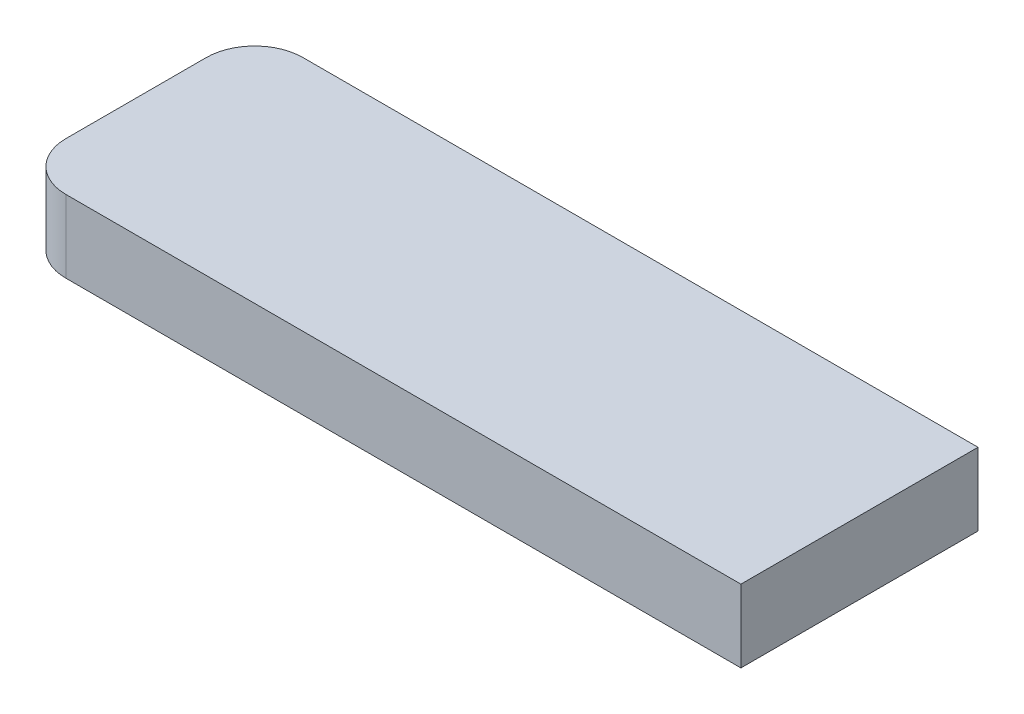
ISO-10303-21;
HEADER;
FILE_DESCRIPTION(('STEP AP214'),'2;1');
FILE_NAME('part.step','',(''),(''),'','','');
FILE_SCHEMA(('AUTOMOTIVE_DESIGN { 1 0 10303 214 1 1 1 1 }'));
ENDSEC;
DATA;
#1=APPLICATION_CONTEXT('core data for automotive mechanical design processes');
#2=APPLICATION_PROTOCOL_DEFINITION('international standard','automotive_design',2000,#1);
#3=PRODUCT_CONTEXT('',#1,'mechanical');
#4=PRODUCT('Part','Part','',(#3));
#5=PRODUCT_RELATED_PRODUCT_CATEGORY('part','',(#4));
#6=PRODUCT_DEFINITION_FORMATION('','',#4);
#7=PRODUCT_DEFINITION_CONTEXT('part definition',#1,'design');
#8=PRODUCT_DEFINITION('design','',#6,#7);
#9=PRODUCT_DEFINITION_SHAPE('','',#8);
#10=(LENGTH_UNIT() NAMED_UNIT(*) SI_UNIT(.MILLI.,.METRE.));
#11=(NAMED_UNIT(*) PLANE_ANGLE_UNIT() SI_UNIT($,.RADIAN.));
#12=(NAMED_UNIT(*) SI_UNIT($,.STERADIAN.) SOLID_ANGLE_UNIT());
#13=UNCERTAINTY_MEASURE_WITH_UNIT(LENGTH_MEASURE(1.E-05),#10,'distance_accuracy_value','');
#14=(GEOMETRIC_REPRESENTATION_CONTEXT(3) GLOBAL_UNCERTAINTY_ASSIGNED_CONTEXT((#13)) GLOBAL_UNIT_ASSIGNED_CONTEXT((#10,
#11,#12)) REPRESENTATION_CONTEXT('',''));
#15=CARTESIAN_POINT('',(0.,0.,0.));
#16=DIRECTION('',(0.,0.,1.));
#17=DIRECTION('',(1.,0.,0.));
#18=AXIS2_PLACEMENT_3D('',#15,#16,#17);
#19=CARTESIAN_POINT('',(300.,1.71683972880179E-13,0.));
#20=DIRECTION('',(-1.,0.,0.));
#21=DIRECTION('',(0.,-1.,0.));
#22=AXIS2_PLACEMENT_3D('',#19,#20,#21);
#23=PLANE('',#22);
#24=DIRECTION('',(0.,0.,1.));
#25=VECTOR('',#24,1.);
#26=CARTESIAN_POINT('',(300.,-47.,3.));
#27=LINE('',#26,#25);
#28=CARTESIAN_POINT('',(300.,-47.,40.1));
#29=VERTEX_POINT('',#28);
#30=CARTESIAN_POINT('',(300.,-47.,49.9));
#31=VERTEX_POINT('',#30);
#32=EDGE_CURVE('E97',#29,#31,#27,.T.);
#33=ORIENTED_EDGE('',*,*,#32,.T.);
#34=DIRECTION('',(0.,1.,0.));
#35=VECTOR('',#34,1.);
#36=CARTESIAN_POINT('',(300.,-120.,49.9));
#37=LINE('',#36,#35);
#38=CARTESIAN_POINT('',(300.,-50.,49.9));
#39=VERTEX_POINT('',#38);
#40=EDGE_CURVE('E56',#39,#31,#37,.T.);
#41=ORIENTED_EDGE('',*,*,#40,.F.);
#42=DIRECTION('',(0.,0.,-1.));
#43=VECTOR('',#42,1.);
#44=CARTESIAN_POINT('',(300.,-50.,60.));
#45=LINE('',#44,#43);
#46=CARTESIAN_POINT('',(300.,-50.,40.1));
#47=VERTEX_POINT('',#46);
#48=EDGE_CURVE('E49',#39,#47,#45,.T.);
#49=ORIENTED_EDGE('',*,*,#48,.T.);
#50=DIRECTION('',(0.,1.,0.));
#51=VECTOR('',#50,1.);
#52=CARTESIAN_POINT('',(300.,-120.,40.1));
#53=LINE('',#52,#51);
#54=EDGE_CURVE('E36',#47,#29,#53,.T.);
#55=ORIENTED_EDGE('',*,*,#54,.T.);
#56=EDGE_LOOP('',(#33,#41,#49,#55));
#57=FACE_BOUND('',#56,.T.);
#58=ADVANCED_FACE('F32',(#57),#23,.F.);
#59=CARTESIAN_POINT('',(270.1,-120.,13.1));
#60=DIRECTION('',(1.,0.,0.));
#61=DIRECTION('',(0.,0.,-1.));
#62=AXIS2_PLACEMENT_3D('',#59,#60,#61);
#63=PLANE('',#62);
#64=DIRECTION('',(0.,0.,-1.));
#65=VECTOR('',#64,1.);
#66=CARTESIAN_POINT('',(270.1,-50.,60.));
#67=LINE('',#66,#65);
#68=CARTESIAN_POINT('',(270.1,-50.,47.9));
#69=VERTEX_POINT('',#68);
#70=CARTESIAN_POINT('',(270.1,-50.,42.1));
#71=VERTEX_POINT('',#70);
#72=EDGE_CURVE('E11',#69,#71,#67,.T.);
#73=ORIENTED_EDGE('',*,*,#72,.F.);
#74=DIRECTION('',(0.,-1.,0.));
#75=VECTOR('',#74,1.);
#76=CARTESIAN_POINT('',(270.1,-120.,47.9));
#77=LINE('',#76,#75);
#78=CARTESIAN_POINT('',(270.1,-47.,47.9));
#79=VERTEX_POINT('',#78);
#80=EDGE_CURVE('E121',#69,#79,#77,.F.);
#81=ORIENTED_EDGE('',*,*,#80,.T.);
#82=DIRECTION('',(0.,0.,1.));
#83=VECTOR('',#82,1.);
#84=CARTESIAN_POINT('',(270.1,-47.,3.));
#85=LINE('',#84,#83);
#86=CARTESIAN_POINT('',(270.1,-47.,42.1));
#87=VERTEX_POINT('',#86);
#88=EDGE_CURVE('E41',#87,#79,#85,.T.);
#89=ORIENTED_EDGE('',*,*,#88,.F.);
#90=DIRECTION('',(0.,1.,0.));
#91=VECTOR('',#90,1.);
#92=CARTESIAN_POINT('',(270.1,-120.,42.1));
#93=LINE('',#92,#91);
#94=EDGE_CURVE('E123',#87,#71,#93,.F.);
#95=ORIENTED_EDGE('',*,*,#94,.T.);
#96=EDGE_LOOP('',(#73,#81,#89,#95));
#97=FACE_BOUND('',#96,.T.);
#98=ADVANCED_FACE('F135',(#97),#63,.F.);
#99=CARTESIAN_POINT('',(272.1,-120.,42.1));
#100=DIRECTION('',(0.,1.,0.));
#101=DIRECTION('',(0.,0.,1.));
#102=AXIS2_PLACEMENT_3D('',#99,#100,#101);
#103=CYLINDRICAL_SURFACE('',#102,2.);
#104=CARTESIAN_POINT('',(272.1,-50.,42.1));
#105=DIRECTION('',(0.,1.,0.));
#106=DIRECTION('',(0.,0.,1.));
#107=AXIS2_PLACEMENT_3D('',#104,#105,#106);
#108=CIRCLE('',#107,2.);
#109=CARTESIAN_POINT('',(272.1,-50.,40.1));
#110=VERTEX_POINT('',#109);
#111=EDGE_CURVE('E100',#71,#110,#108,.F.);
#112=ORIENTED_EDGE('',*,*,#111,.F.);
#113=ORIENTED_EDGE('',*,*,#94,.F.);
#114=CARTESIAN_POINT('',(272.1,-47.,42.1));
#115=DIRECTION('',(0.,-1.,0.));
#116=DIRECTION('',(0.,0.,-1.));
#117=AXIS2_PLACEMENT_3D('',#114,#115,#116);
#118=CIRCLE('',#117,2.);
#119=CARTESIAN_POINT('',(272.1,-47.,40.1));
#120=VERTEX_POINT('',#119);
#121=EDGE_CURVE('E117',#120,#87,#118,.F.);
#122=ORIENTED_EDGE('',*,*,#121,.F.);
#123=DIRECTION('',(0.,1.,0.));
#124=VECTOR('',#123,1.);
#125=CARTESIAN_POINT('',(272.1,-120.,40.1));
#126=LINE('',#125,#124);
#127=EDGE_CURVE('E114',#110,#120,#126,.T.);
#128=ORIENTED_EDGE('',*,*,#127,.F.);
#129=EDGE_LOOP('',(#112,#113,#122,#128));
#130=FACE_BOUND('',#129,.T.);
#131=ADVANCED_FACE('F142',(#130),#103,.T.);
#132=CARTESIAN_POINT('',(-300.,-50.,60.));
#133=DIRECTION('',(0.,1.,0.));
#134=DIRECTION('',(0.,0.,1.));
#135=AXIS2_PLACEMENT_3D('',#132,#133,#134);
#136=PLANE('',#135);
#137=DIRECTION('',(-1.,0.,0.));
#138=VECTOR('',#137,1.);
#139=CARTESIAN_POINT('',(-300.,-50.,49.9));
#140=LINE('',#139,#138);
#141=CARTESIAN_POINT('',(272.1,-50.,49.9));
#142=VERTEX_POINT('',#141);
#143=EDGE_CURVE('E104',#39,#142,#140,.T.);
#144=ORIENTED_EDGE('',*,*,#143,.T.);
#145=CARTESIAN_POINT('',(272.1,-50.,47.9));
#146=DIRECTION('',(0.,1.,0.));
#147=DIRECTION('',(0.,0.,1.));
#148=AXIS2_PLACEMENT_3D('',#145,#146,#147);
#149=CIRCLE('',#148,2.);
#150=EDGE_CURVE('E125',#142,#69,#149,.F.);
#151=ORIENTED_EDGE('',*,*,#150,.T.);
#152=ORIENTED_EDGE('',*,*,#72,.T.);
#153=ORIENTED_EDGE('',*,*,#111,.T.);
#154=DIRECTION('',(1.,0.,0.));
#155=VECTOR('',#154,1.);
#156=CARTESIAN_POINT('',(-300.,-50.,40.1));
#157=LINE('',#156,#155);
#158=EDGE_CURVE('E91',#110,#47,#157,.T.);
#159=ORIENTED_EDGE('',*,*,#158,.T.);
#160=ORIENTED_EDGE('',*,*,#48,.F.);
#161=EDGE_LOOP('',(#144,#151,#152,#153,#159,#160));
#162=FACE_BOUND('',#161,.T.);
#163=ADVANCED_FACE('F98',(#162),#136,.F.);
#164=CARTESIAN_POINT('',(272.1,-120.,47.9));
#165=DIRECTION('',(0.,-1.,0.));
#166=DIRECTION('',(0.,0.,-1.));
#167=AXIS2_PLACEMENT_3D('',#164,#165,#166);
#168=CYLINDRICAL_SURFACE('',#167,2.);
#169=CARTESIAN_POINT('',(272.1,-47.,47.9));
#170=DIRECTION('',(0.,-1.,0.));
#171=DIRECTION('',(0.,0.,-1.));
#172=AXIS2_PLACEMENT_3D('',#169,#170,#171);
#173=CIRCLE('',#172,2.);
#174=CARTESIAN_POINT('',(272.1,-47.,49.9));
#175=VERTEX_POINT('',#174);
#176=EDGE_CURVE('E115',#79,#175,#173,.F.);
#177=ORIENTED_EDGE('',*,*,#176,.F.);
#178=ORIENTED_EDGE('',*,*,#80,.F.);
#179=ORIENTED_EDGE('',*,*,#150,.F.);
#180=DIRECTION('',(0.,-1.,0.));
#181=VECTOR('',#180,1.);
#182=CARTESIAN_POINT('',(272.1,-120.,49.9));
#183=LINE('',#182,#181);
#184=EDGE_CURVE('E106',#175,#142,#183,.T.);
#185=ORIENTED_EDGE('',*,*,#184,.F.);
#186=EDGE_LOOP('',(#177,#178,#179,#185));
#187=FACE_BOUND('',#186,.T.);
#188=ADVANCED_FACE('F138',(#187),#168,.T.);
#189=CARTESIAN_POINT('',(-300.,-47.,3.));
#190=DIRECTION('',(0.,-1.,0.));
#191=DIRECTION('',(0.,0.,-1.));
#192=AXIS2_PLACEMENT_3D('',#189,#190,#191);
#193=PLANE('',#192);
#194=ORIENTED_EDGE('',*,*,#88,.T.);
#195=ORIENTED_EDGE('',*,*,#176,.T.);
#196=DIRECTION('',(1.,0.,0.));
#197=VECTOR('',#196,1.);
#198=CARTESIAN_POINT('',(-300.,-47.,49.9));
#199=LINE('',#198,#197);
#200=EDGE_CURVE('E101',#175,#31,#199,.T.);
#201=ORIENTED_EDGE('',*,*,#200,.T.);
#202=ORIENTED_EDGE('',*,*,#32,.F.);
#203=DIRECTION('',(-1.,0.,0.));
#204=VECTOR('',#203,1.);
#205=CARTESIAN_POINT('',(-300.,-47.,40.1));
#206=LINE('',#205,#204);
#207=EDGE_CURVE('E94',#29,#120,#206,.T.);
#208=ORIENTED_EDGE('',*,*,#207,.T.);
#209=ORIENTED_EDGE('',*,*,#121,.T.);
#210=EDGE_LOOP('',(#194,#195,#201,#202,#208,#209));
#211=FACE_BOUND('',#210,.T.);
#212=ADVANCED_FACE('F140',(#211),#193,.F.);
#213=CARTESIAN_POINT('',(270.,-120.,49.9));
#214=DIRECTION('',(0.,0.,-1.));
#215=DIRECTION('',(-1.,0.,0.));
#216=AXIS2_PLACEMENT_3D('',#213,#214,#215);
#217=PLANE('',#216);
#218=ORIENTED_EDGE('',*,*,#200,.F.);
#219=ORIENTED_EDGE('',*,*,#184,.T.);
#220=ORIENTED_EDGE('',*,*,#143,.F.);
#221=ORIENTED_EDGE('',*,*,#40,.T.);
#222=EDGE_LOOP('',(#218,#219,#220,#221));
#223=FACE_BOUND('',#222,.T.);
#224=ADVANCED_FACE('F129',(#223),#217,.F.);
#225=CARTESIAN_POINT('',(300.,-120.,40.1));
#226=DIRECTION('',(0.,0.,1.));
#227=DIRECTION('',(1.,0.,0.));
#228=AXIS2_PLACEMENT_3D('',#225,#226,#227);
#229=PLANE('',#228);
#230=ORIENTED_EDGE('',*,*,#158,.F.);
#231=ORIENTED_EDGE('',*,*,#127,.T.);
#232=ORIENTED_EDGE('',*,*,#207,.F.);
#233=ORIENTED_EDGE('',*,*,#54,.F.);
#234=EDGE_LOOP('',(#230,#231,#232,#233));
#235=FACE_BOUND('',#234,.T.);
#236=ADVANCED_FACE('F34',(#235),#229,.F.);
#237=CLOSED_SHELL('',(#58,#98,#131,#163,#188,#212,#224,#236));
#238=MANIFOLD_SOLID_BREP('B2',#237);
#239=ADVANCED_BREP_SHAPE_REPRESENTATION('',(#18,#238),#14);
#240=SHAPE_DEFINITION_REPRESENTATION(#9,#239);
ENDSEC;
END-ISO-10303-21;
